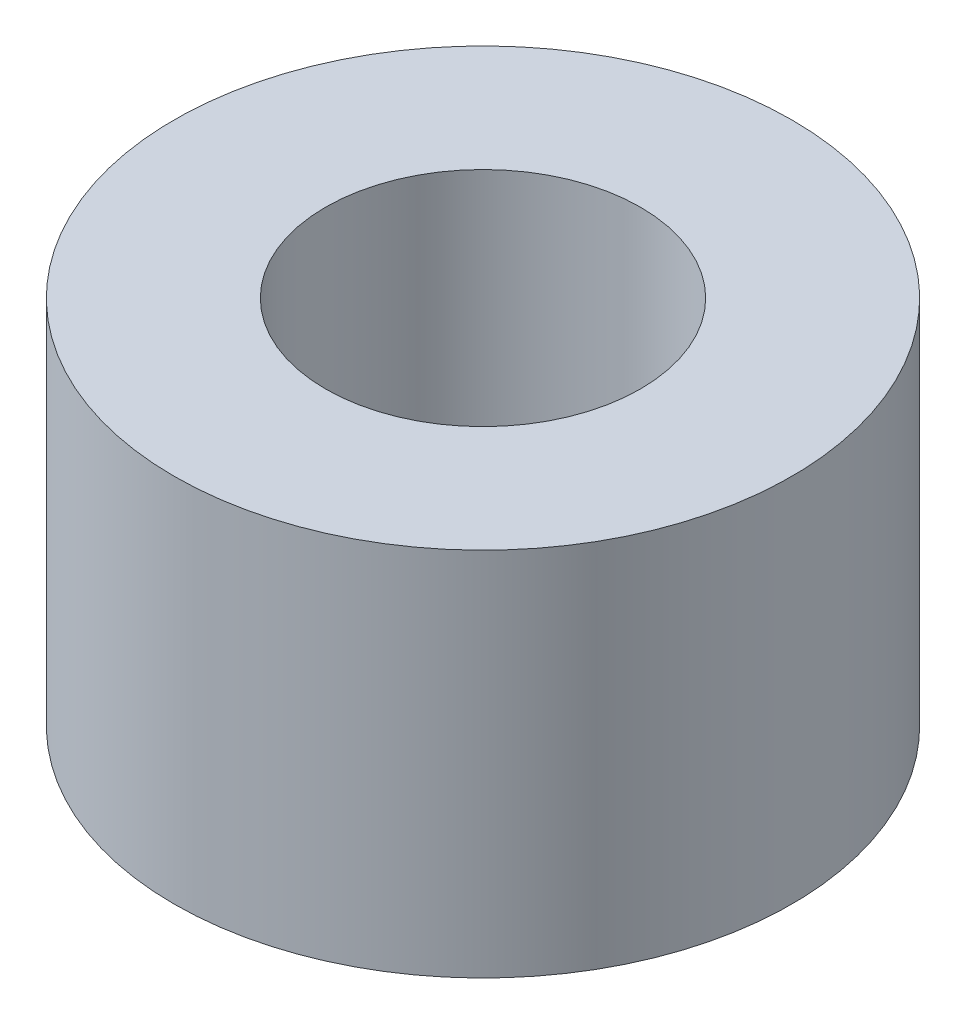
ISO-10303-21;
HEADER;
FILE_DESCRIPTION(('STEP AP214'),'2;1');
FILE_NAME('part.step','',(''),(''),'','','');
FILE_SCHEMA(('AUTOMOTIVE_DESIGN { 1 0 10303 214 1 1 1 1 }'));
ENDSEC;
DATA;
#1=APPLICATION_CONTEXT('core data for automotive mechanical design processes');
#2=APPLICATION_PROTOCOL_DEFINITION('international standard','automotive_design',2000,#1);
#3=PRODUCT_CONTEXT('',#1,'mechanical');
#4=PRODUCT('Part','Part','',(#3));
#5=PRODUCT_RELATED_PRODUCT_CATEGORY('part','',(#4));
#6=PRODUCT_DEFINITION_FORMATION('','',#4);
#7=PRODUCT_DEFINITION_CONTEXT('part definition',#1,'design');
#8=PRODUCT_DEFINITION('design','',#6,#7);
#9=PRODUCT_DEFINITION_SHAPE('','',#8);
#10=(LENGTH_UNIT() NAMED_UNIT(*) SI_UNIT(.MILLI.,.METRE.));
#11=(NAMED_UNIT(*) PLANE_ANGLE_UNIT() SI_UNIT($,.RADIAN.));
#12=(NAMED_UNIT(*) SI_UNIT($,.STERADIAN.) SOLID_ANGLE_UNIT());
#13=UNCERTAINTY_MEASURE_WITH_UNIT(LENGTH_MEASURE(1.E-05),#10,'distance_accuracy_value','');
#14=(GEOMETRIC_REPRESENTATION_CONTEXT(3) GLOBAL_UNCERTAINTY_ASSIGNED_CONTEXT((#13)) GLOBAL_UNIT_ASSIGNED_CONTEXT((#10,
#11,#12)) REPRESENTATION_CONTEXT('',''));
#15=CARTESIAN_POINT('',(0.,0.,0.));
#16=DIRECTION('',(0.,0.,1.));
#17=DIRECTION('',(1.,0.,0.));
#18=AXIS2_PLACEMENT_3D('',#15,#16,#17);
#19=CARTESIAN_POINT('',(0.,6.,0.));
#20=DIRECTION('',(0.,1.,0.));
#21=DIRECTION('',(0.,0.,1.));
#22=AXIS2_PLACEMENT_3D('',#19,#20,#21);
#23=PLANE('',#22);
#24=CARTESIAN_POINT('',(0.,6.,0.));
#25=DIRECTION('',(0.,1.,0.));
#26=DIRECTION('',(0.,0.,1.));
#27=AXIS2_PLACEMENT_3D('',#24,#25,#26);
#28=CIRCLE('',#27,5.);
#29=CARTESIAN_POINT('',(0.,6.,5.));
#30=VERTEX_POINT('',#29);
#31=EDGE_CURVE('E10',#30,#30,#28,.T.);
#32=ORIENTED_EDGE('',*,*,#31,.T.);
#33=EDGE_LOOP('',(#32));
#34=FACE_BOUND('',#33,.T.);
#35=CARTESIAN_POINT('',(0.,6.,0.));
#36=DIRECTION('',(0.,1.,0.));
#37=DIRECTION('',(0.,0.,1.));
#38=AXIS2_PLACEMENT_3D('',#35,#36,#37);
#39=CIRCLE('',#38,2.55);
#40=CARTESIAN_POINT('',(0.,6.,2.55));
#41=VERTEX_POINT('',#40);
#42=EDGE_CURVE('E42',#41,#41,#39,.T.);
#43=ORIENTED_EDGE('',*,*,#42,.F.);
#44=EDGE_LOOP('',(#43));
#45=FACE_BOUND('',#44,.T.);
#46=ADVANCED_FACE('F31',(#34,#45),#23,.T.);
#47=CARTESIAN_POINT('',(0.,0.,0.));
#48=DIRECTION('',(0.,1.,0.));
#49=DIRECTION('',(0.,0.,1.));
#50=AXIS2_PLACEMENT_3D('',#47,#48,#49);
#51=PLANE('',#50);
#52=CARTESIAN_POINT('',(0.,0.,0.));
#53=DIRECTION('',(0.,1.,0.));
#54=DIRECTION('',(0.,0.,1.));
#55=AXIS2_PLACEMENT_3D('',#52,#53,#54);
#56=CIRCLE('',#55,5.);
#57=CARTESIAN_POINT('',(0.,0.,5.));
#58=VERTEX_POINT('',#57);
#59=EDGE_CURVE('E35',#58,#58,#56,.T.);
#60=ORIENTED_EDGE('',*,*,#59,.F.);
#61=EDGE_LOOP('',(#60));
#62=FACE_BOUND('',#61,.T.);
#63=CARTESIAN_POINT('',(0.,0.,0.));
#64=DIRECTION('',(0.,1.,0.));
#65=DIRECTION('',(0.,0.,1.));
#66=AXIS2_PLACEMENT_3D('',#63,#64,#65);
#67=CIRCLE('',#66,2.55);
#68=CARTESIAN_POINT('',(0.,0.,2.55));
#69=VERTEX_POINT('',#68);
#70=EDGE_CURVE('E44',#69,#69,#67,.T.);
#71=ORIENTED_EDGE('',*,*,#70,.T.);
#72=EDGE_LOOP('',(#71));
#73=FACE_BOUND('',#72,.T.);
#74=ADVANCED_FACE('F54',(#62,#73),#51,.F.);
#75=CARTESIAN_POINT('',(0.,6.,0.));
#76=DIRECTION('',(0.,-1.,0.));
#77=DIRECTION('',(0.,0.,-1.));
#78=AXIS2_PLACEMENT_3D('',#75,#76,#77);
#79=CYLINDRICAL_SURFACE('',#78,5.);
#80=ORIENTED_EDGE('',*,*,#31,.F.);
#81=EDGE_LOOP('',(#80));
#82=FACE_BOUND('',#81,.T.);
#83=ORIENTED_EDGE('',*,*,#59,.T.);
#84=EDGE_LOOP('',(#83));
#85=FACE_BOUND('',#84,.T.);
#86=ADVANCED_FACE('F33',(#82,#85),#79,.T.);
#87=CARTESIAN_POINT('',(0.,6.,0.));
#88=DIRECTION('',(0.,-1.,0.));
#89=DIRECTION('',(0.,0.,-1.));
#90=AXIS2_PLACEMENT_3D('',#87,#88,#89);
#91=CYLINDRICAL_SURFACE('',#90,2.55);
#92=ORIENTED_EDGE('',*,*,#42,.T.);
#93=EDGE_LOOP('',(#92));
#94=FACE_BOUND('',#93,.T.);
#95=ORIENTED_EDGE('',*,*,#70,.F.);
#96=EDGE_LOOP('',(#95));
#97=FACE_BOUND('',#96,.T.);
#98=ADVANCED_FACE('F50',(#94,#97),#91,.F.);
#99=CLOSED_SHELL('',(#46,#74,#86,#98));
#100=MANIFOLD_SOLID_BREP('B2',#99);
#101=ADVANCED_BREP_SHAPE_REPRESENTATION('',(#18,#100),#14);
#102=SHAPE_DEFINITION_REPRESENTATION(#9,#101);
ENDSEC;
END-ISO-10303-21;
